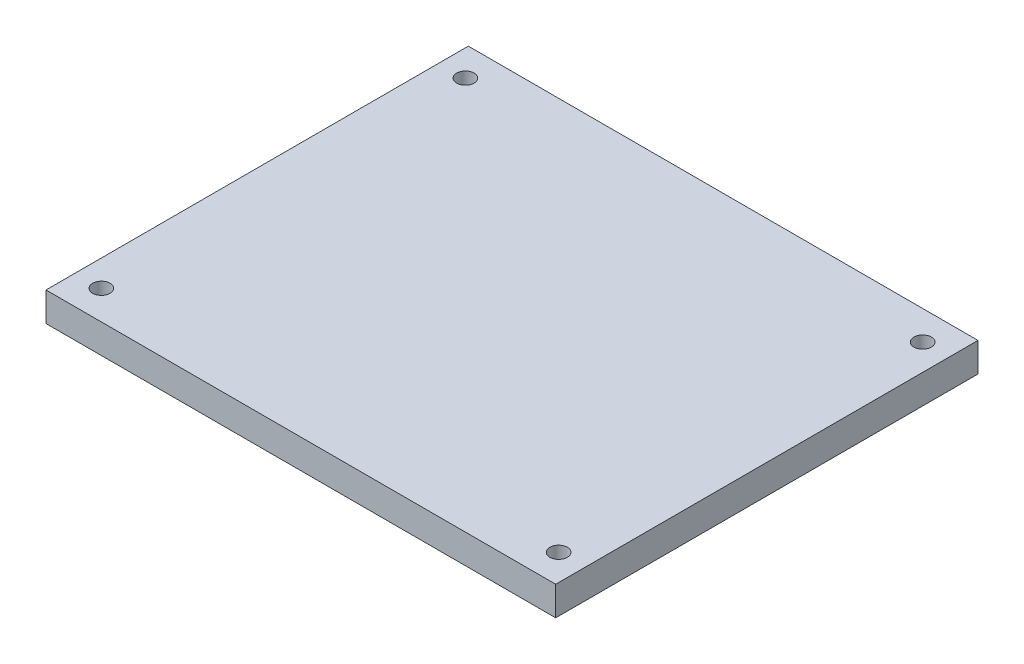
ISO-10303-21;
HEADER;
FILE_DESCRIPTION(('STEP AP214'),'2;1');
FILE_NAME('part.step','',(''),(''),'','','');
FILE_SCHEMA(('AUTOMOTIVE_DESIGN { 1 0 10303 214 1 1 1 1 }'));
ENDSEC;
DATA;
#1=APPLICATION_CONTEXT('core data for automotive mechanical design processes');
#2=APPLICATION_PROTOCOL_DEFINITION('international standard','automotive_design',2000,#1);
#3=PRODUCT_CONTEXT('',#1,'mechanical');
#4=PRODUCT('Part','Part','',(#3));
#5=PRODUCT_RELATED_PRODUCT_CATEGORY('part','',(#4));
#6=PRODUCT_DEFINITION_FORMATION('','',#4);
#7=PRODUCT_DEFINITION_CONTEXT('part definition',#1,'design');
#8=PRODUCT_DEFINITION('design','',#6,#7);
#9=PRODUCT_DEFINITION_SHAPE('','',#8);
#10=(LENGTH_UNIT() NAMED_UNIT(*) SI_UNIT(.MILLI.,.METRE.));
#11=(NAMED_UNIT(*) PLANE_ANGLE_UNIT() SI_UNIT($,.RADIAN.));
#12=(NAMED_UNIT(*) SI_UNIT($,.STERADIAN.) SOLID_ANGLE_UNIT());
#13=UNCERTAINTY_MEASURE_WITH_UNIT(LENGTH_MEASURE(1.E-05),#10,'distance_accuracy_value','');
#14=(GEOMETRIC_REPRESENTATION_CONTEXT(3) GLOBAL_UNCERTAINTY_ASSIGNED_CONTEXT((#13)) GLOBAL_UNIT_ASSIGNED_CONTEXT((#10,
#11,#12)) REPRESENTATION_CONTEXT('',''));
#15=CARTESIAN_POINT('',(0.,0.,0.));
#16=DIRECTION('',(0.,0.,1.));
#17=DIRECTION('',(1.,0.,0.));
#18=AXIS2_PLACEMENT_3D('',#15,#16,#17);
#19=CARTESIAN_POINT('',(0.,5.,0.));
#20=DIRECTION('',(0.,0.,-1.));
#21=DIRECTION('',(-1.,0.,0.));
#22=AXIS2_PLACEMENT_3D('',#19,#20,#21);
#23=PLANE('',#22);
#24=DIRECTION('',(1.,0.,0.));
#25=VECTOR('',#24,1.);
#26=CARTESIAN_POINT('',(0.,0.,0.));
#27=LINE('',#26,#25);
#28=CARTESIAN_POINT('',(0.,0.,0.));
#29=VERTEX_POINT('',#28);
#30=CARTESIAN_POINT('',(87.5,0.,0.));
#31=VERTEX_POINT('',#30);
#32=EDGE_CURVE('E104',#29,#31,#27,.T.);
#33=ORIENTED_EDGE('',*,*,#32,.F.);
#34=DIRECTION('',(0.,-1.,0.));
#35=VECTOR('',#34,1.);
#36=CARTESIAN_POINT('',(0.,5.,0.));
#37=LINE('',#36,#35);
#38=CARTESIAN_POINT('',(0.,5.,0.));
#39=VERTEX_POINT('',#38);
#40=EDGE_CURVE('E11',#39,#29,#37,.T.);
#41=ORIENTED_EDGE('',*,*,#40,.F.);
#42=DIRECTION('',(1.,0.,0.));
#43=VECTOR('',#42,1.);
#44=CARTESIAN_POINT('',(0.,5.,0.));
#45=LINE('',#44,#43);
#46=CARTESIAN_POINT('',(87.5,5.,0.));
#47=VERTEX_POINT('',#46);
#48=EDGE_CURVE('E98',#39,#47,#45,.T.);
#49=ORIENTED_EDGE('',*,*,#48,.T.);
#50=DIRECTION('',(0.,-1.,0.));
#51=VECTOR('',#50,1.);
#52=CARTESIAN_POINT('',(87.5,5.,0.));
#53=LINE('',#52,#51);
#54=EDGE_CURVE('E41',#47,#31,#53,.T.);
#55=ORIENTED_EDGE('',*,*,#54,.T.);
#56=EDGE_LOOP('',(#33,#41,#49,#55));
#57=FACE_BOUND('',#56,.T.);
#58=ADVANCED_FACE('F38',(#57),#23,.T.);
#59=CARTESIAN_POINT('',(0.,5.,0.));
#60=DIRECTION('',(1.,0.,0.));
#61=DIRECTION('',(0.,0.,-1.));
#62=AXIS2_PLACEMENT_3D('',#59,#60,#61);
#63=PLANE('',#62);
#64=DIRECTION('',(0.,0.,1.));
#65=VECTOR('',#64,1.);
#66=CARTESIAN_POINT('',(0.,0.,0.));
#67=LINE('',#66,#65);
#68=CARTESIAN_POINT('',(0.,0.,72.5));
#69=VERTEX_POINT('',#68);
#70=EDGE_CURVE('E71',#29,#69,#67,.T.);
#71=ORIENTED_EDGE('',*,*,#70,.T.);
#72=DIRECTION('',(0.,-1.,0.));
#73=VECTOR('',#72,1.);
#74=CARTESIAN_POINT('',(0.,5.,72.5));
#75=LINE('',#74,#73);
#76=CARTESIAN_POINT('',(0.,5.,72.5));
#77=VERTEX_POINT('',#76);
#78=EDGE_CURVE('E47',#77,#69,#75,.T.);
#79=ORIENTED_EDGE('',*,*,#78,.F.);
#80=DIRECTION('',(0.,0.,1.));
#81=VECTOR('',#80,1.);
#82=CARTESIAN_POINT('',(0.,5.,0.));
#83=LINE('',#82,#81);
#84=EDGE_CURVE('E86',#39,#77,#83,.T.);
#85=ORIENTED_EDGE('',*,*,#84,.F.);
#86=ORIENTED_EDGE('',*,*,#40,.T.);
#87=EDGE_LOOP('',(#71,#79,#85,#86));
#88=FACE_BOUND('',#87,.T.);
#89=ADVANCED_FACE('F115',(#88),#63,.F.);
#90=CARTESIAN_POINT('',(0.,5.,72.5));
#91=DIRECTION('',(0.,0.,-1.));
#92=DIRECTION('',(-1.,0.,0.));
#93=AXIS2_PLACEMENT_3D('',#90,#91,#92);
#94=PLANE('',#93);
#95=DIRECTION('',(1.,0.,0.));
#96=VECTOR('',#95,1.);
#97=CARTESIAN_POINT('',(0.,0.,72.5));
#98=LINE('',#97,#96);
#99=CARTESIAN_POINT('',(87.5,0.,72.5));
#100=VERTEX_POINT('',#99);
#101=EDGE_CURVE('E93',#69,#100,#98,.T.);
#102=ORIENTED_EDGE('',*,*,#101,.T.);
#103=DIRECTION('',(0.,-1.,0.));
#104=VECTOR('',#103,1.);
#105=CARTESIAN_POINT('',(87.5,5.,72.5));
#106=LINE('',#105,#104);
#107=CARTESIAN_POINT('',(87.5,5.,72.5));
#108=VERTEX_POINT('',#107);
#109=EDGE_CURVE('E90',#108,#100,#106,.T.);
#110=ORIENTED_EDGE('',*,*,#109,.F.);
#111=DIRECTION('',(1.,0.,0.));
#112=VECTOR('',#111,1.);
#113=CARTESIAN_POINT('',(0.,5.,72.5));
#114=LINE('',#113,#112);
#115=EDGE_CURVE('E83',#77,#108,#114,.T.);
#116=ORIENTED_EDGE('',*,*,#115,.F.);
#117=ORIENTED_EDGE('',*,*,#78,.T.);
#118=EDGE_LOOP('',(#102,#110,#116,#117));
#119=FACE_BOUND('',#118,.T.);
#120=ADVANCED_FACE('F91',(#119),#94,.F.);
#121=CARTESIAN_POINT('',(87.5,5.,72.5));
#122=DIRECTION('',(-1.,0.,0.));
#123=DIRECTION('',(0.,0.,1.));
#124=AXIS2_PLACEMENT_3D('',#121,#122,#123);
#125=PLANE('',#124);
#126=DIRECTION('',(0.,0.,-1.));
#127=VECTOR('',#126,1.);
#128=CARTESIAN_POINT('',(87.5,0.,72.5));
#129=LINE('',#128,#127);
#130=EDGE_CURVE('E107',#100,#31,#129,.T.);
#131=ORIENTED_EDGE('',*,*,#130,.T.);
#132=ORIENTED_EDGE('',*,*,#54,.F.);
#133=DIRECTION('',(0.,0.,-1.));
#134=VECTOR('',#133,1.);
#135=CARTESIAN_POINT('',(87.5,5.,72.5));
#136=LINE('',#135,#134);
#137=EDGE_CURVE('E80',#108,#47,#136,.T.);
#138=ORIENTED_EDGE('',*,*,#137,.F.);
#139=ORIENTED_EDGE('',*,*,#109,.T.);
#140=EDGE_LOOP('',(#131,#132,#138,#139));
#141=FACE_BOUND('',#140,.T.);
#142=ADVANCED_FACE('F97',(#141),#125,.F.);
#143=CARTESIAN_POINT('',(0.,5.,0.));
#144=DIRECTION('',(0.,1.,0.));
#145=DIRECTION('',(0.,0.,1.));
#146=AXIS2_PLACEMENT_3D('',#143,#144,#145);
#147=PLANE('',#146);
#148=CARTESIAN_POINT('',(82.9999524184348,5.,67.4999532708682));
#149=DIRECTION('',(0.,1.,0.));
#150=DIRECTION('',(0.,0.,1.));
#151=AXIS2_PLACEMENT_3D('',#148,#149,#150);
#152=CIRCLE('',#151,1.5);
#153=CARTESIAN_POINT('',(82.9999524184348,5.,68.9999532708682));
#154=VERTEX_POINT('',#153);
#155=EDGE_CURVE('E157',#154,#154,#152,.T.);
#156=ORIENTED_EDGE('',*,*,#155,.F.);
#157=EDGE_LOOP('',(#156));
#158=FACE_BOUND('',#157,.T.);
#159=CARTESIAN_POINT('',(82.9985112966227,5.,4.99769096553759));
#160=DIRECTION('',(0.,1.,0.));
#161=DIRECTION('',(0.,0.,1.));
#162=AXIS2_PLACEMENT_3D('',#159,#160,#161);
#163=CIRCLE('',#162,1.5);
#164=CARTESIAN_POINT('',(82.9985112966227,5.,6.4976909655376));
#165=VERTEX_POINT('',#164);
#166=EDGE_CURVE('E167',#165,#165,#163,.T.);
#167=ORIENTED_EDGE('',*,*,#166,.F.);
#168=EDGE_LOOP('',(#167));
#169=FACE_BOUND('',#168,.T.);
#170=CARTESIAN_POINT('',(4.50048191691721,5.,67.4997140859546));
#171=DIRECTION('',(0.,1.,0.));
#172=DIRECTION('',(0.,0.,1.));
#173=AXIS2_PLACEMENT_3D('',#170,#171,#172);
#174=CIRCLE('',#173,1.5);
#175=CARTESIAN_POINT('',(4.50048191691721,5.,68.9997140859546));
#176=VERTEX_POINT('',#175);
#177=EDGE_CURVE('E173',#176,#176,#174,.T.);
#178=ORIENTED_EDGE('',*,*,#177,.F.);
#179=EDGE_LOOP('',(#178));
#180=FACE_BOUND('',#179,.T.);
#181=CARTESIAN_POINT('',(4.50023720277093,5.,5.00051137605073));
#182=DIRECTION('',(0.,1.,0.));
#183=DIRECTION('',(0.,0.,1.));
#184=AXIS2_PLACEMENT_3D('',#181,#182,#183);
#185=CIRCLE('',#184,1.5);
#186=CARTESIAN_POINT('',(4.50023720277093,5.,6.50051137605073));
#187=VERTEX_POINT('',#186);
#188=EDGE_CURVE('E108',#187,#187,#185,.T.);
#189=ORIENTED_EDGE('',*,*,#188,.F.);
#190=EDGE_LOOP('',(#189));
#191=FACE_BOUND('',#190,.T.);
#192=ORIENTED_EDGE('',*,*,#48,.F.);
#193=ORIENTED_EDGE('',*,*,#84,.T.);
#194=ORIENTED_EDGE('',*,*,#115,.T.);
#195=ORIENTED_EDGE('',*,*,#137,.T.);
#196=EDGE_LOOP('',(#192,#193,#194,#195));
#197=FACE_BOUND('',#196,.T.);
#198=ADVANCED_FACE('F85',(#158,#169,#180,#191,#197),#147,.T.);
#199=CARTESIAN_POINT('',(0.,0.,0.));
#200=DIRECTION('',(0.,1.,0.));
#201=DIRECTION('',(0.,0.,1.));
#202=AXIS2_PLACEMENT_3D('',#199,#200,#201);
#203=PLANE('',#202);
#204=CARTESIAN_POINT('',(82.9999524184348,0.,67.4999532708682));
#205=DIRECTION('',(0.,-1.,0.));
#206=DIRECTION('',(0.,0.,-1.));
#207=AXIS2_PLACEMENT_3D('',#204,#205,#206);
#208=CIRCLE('',#207,1.5);
#209=CARTESIAN_POINT('',(82.9999524184348,0.,65.9999532708682));
#210=VERTEX_POINT('',#209);
#211=EDGE_CURVE('E160',#210,#210,#208,.T.);
#212=ORIENTED_EDGE('',*,*,#211,.F.);
#213=EDGE_LOOP('',(#212));
#214=FACE_BOUND('',#213,.T.);
#215=CARTESIAN_POINT('',(82.9985112966227,0.,4.99769096553759));
#216=DIRECTION('',(0.,-1.,0.));
#217=DIRECTION('',(0.,0.,-1.));
#218=AXIS2_PLACEMENT_3D('',#215,#216,#217);
#219=CIRCLE('',#218,1.5);
#220=CARTESIAN_POINT('',(82.9985112966227,0.,3.49769096553759));
#221=VERTEX_POINT('',#220);
#222=EDGE_CURVE('E162',#221,#221,#219,.T.);
#223=ORIENTED_EDGE('',*,*,#222,.F.);
#224=EDGE_LOOP('',(#223));
#225=FACE_BOUND('',#224,.T.);
#226=CARTESIAN_POINT('',(4.50048191691721,0.,67.4997140859546));
#227=DIRECTION('',(0.,-1.,0.));
#228=DIRECTION('',(0.,0.,-1.));
#229=AXIS2_PLACEMENT_3D('',#226,#227,#228);
#230=CIRCLE('',#229,1.5);
#231=CARTESIAN_POINT('',(4.50048191691721,0.,65.9997140859546));
#232=VERTEX_POINT('',#231);
#233=EDGE_CURVE('E170',#232,#232,#230,.T.);
#234=ORIENTED_EDGE('',*,*,#233,.F.);
#235=EDGE_LOOP('',(#234));
#236=FACE_BOUND('',#235,.T.);
#237=CARTESIAN_POINT('',(4.50023720277093,0.,5.00051137605073));
#238=DIRECTION('',(0.,-1.,0.));
#239=DIRECTION('',(0.,0.,-1.));
#240=AXIS2_PLACEMENT_3D('',#237,#238,#239);
#241=CIRCLE('',#240,1.5);
#242=CARTESIAN_POINT('',(4.50023720277093,0.,3.50051137605073));
#243=VERTEX_POINT('',#242);
#244=EDGE_CURVE('E176',#243,#243,#241,.T.);
#245=ORIENTED_EDGE('',*,*,#244,.F.);
#246=EDGE_LOOP('',(#245));
#247=FACE_BOUND('',#246,.T.);
#248=ORIENTED_EDGE('',*,*,#32,.T.);
#249=ORIENTED_EDGE('',*,*,#130,.F.);
#250=ORIENTED_EDGE('',*,*,#101,.F.);
#251=ORIENTED_EDGE('',*,*,#70,.F.);
#252=EDGE_LOOP('',(#248,#249,#250,#251));
#253=FACE_BOUND('',#252,.T.);
#254=ADVANCED_FACE('F113',(#214,#225,#236,#247,#253),#203,.F.);
#255=CARTESIAN_POINT('',(4.50023720277093,6.,5.00051137605073));
#256=DIRECTION('',(0.,-1.,0.));
#257=DIRECTION('',(0.,0.,-1.));
#258=AXIS2_PLACEMENT_3D('',#255,#256,#257);
#259=CYLINDRICAL_SURFACE('',#258,1.5);
#260=ORIENTED_EDGE('',*,*,#188,.T.);
#261=EDGE_LOOP('',(#260));
#262=FACE_BOUND('',#261,.T.);
#263=ORIENTED_EDGE('',*,*,#244,.T.);
#264=EDGE_LOOP('',(#263));
#265=FACE_BOUND('',#264,.T.);
#266=ADVANCED_FACE('F134',(#262,#265),#259,.F.);
#267=CARTESIAN_POINT('',(4.50048191691721,6.,67.4997140859546));
#268=DIRECTION('',(0.,-1.,0.));
#269=DIRECTION('',(0.,0.,-1.));
#270=AXIS2_PLACEMENT_3D('',#267,#268,#269);
#271=CYLINDRICAL_SURFACE('',#270,1.5);
#272=ORIENTED_EDGE('',*,*,#177,.T.);
#273=EDGE_LOOP('',(#272));
#274=FACE_BOUND('',#273,.T.);
#275=ORIENTED_EDGE('',*,*,#233,.T.);
#276=EDGE_LOOP('',(#275));
#277=FACE_BOUND('',#276,.T.);
#278=ADVANCED_FACE('F141',(#274,#277),#271,.F.);
#279=CARTESIAN_POINT('',(82.9985112966227,6.,4.99769096553759));
#280=DIRECTION('',(0.,-1.,0.));
#281=DIRECTION('',(0.,0.,-1.));
#282=AXIS2_PLACEMENT_3D('',#279,#280,#281);
#283=CYLINDRICAL_SURFACE('',#282,1.5);
#284=ORIENTED_EDGE('',*,*,#166,.T.);
#285=EDGE_LOOP('',(#284));
#286=FACE_BOUND('',#285,.T.);
#287=ORIENTED_EDGE('',*,*,#222,.T.);
#288=EDGE_LOOP('',(#287));
#289=FACE_BOUND('',#288,.T.);
#290=ADVANCED_FACE('F145',(#286,#289),#283,.F.);
#291=CARTESIAN_POINT('',(82.9999524184348,6.,67.4999532708682));
#292=DIRECTION('',(0.,-1.,0.));
#293=DIRECTION('',(0.,0.,-1.));
#294=AXIS2_PLACEMENT_3D('',#291,#292,#293);
#295=CYLINDRICAL_SURFACE('',#294,1.5);
#296=ORIENTED_EDGE('',*,*,#155,.T.);
#297=EDGE_LOOP('',(#296));
#298=FACE_BOUND('',#297,.T.);
#299=ORIENTED_EDGE('',*,*,#211,.T.);
#300=EDGE_LOOP('',(#299));
#301=FACE_BOUND('',#300,.T.);
#302=ADVANCED_FACE('F149',(#298,#301),#295,.F.);
#303=CLOSED_SHELL('',(#58,#89,#120,#142,#198,#254,#266,#278,#290,#302));
#304=MANIFOLD_SOLID_BREP('B2',#303);
#305=ADVANCED_BREP_SHAPE_REPRESENTATION('',(#18,#304),#14);
#306=SHAPE_DEFINITION_REPRESENTATION(#9,#305);
ENDSEC;
END-ISO-10303-21;
